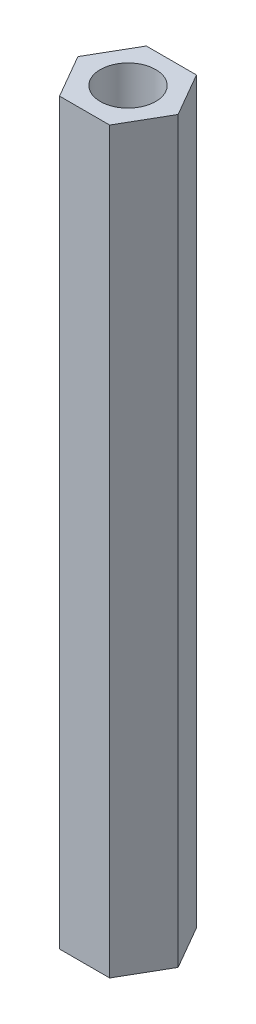
ISO-10303-21;
HEADER;
FILE_DESCRIPTION(('STEP AP214'),'2;1');
FILE_NAME('part.step','',(''),(''),'','','');
FILE_SCHEMA(('AUTOMOTIVE_DESIGN { 1 0 10303 214 1 1 1 1 }'));
ENDSEC;
DATA;
#1=APPLICATION_CONTEXT('core data for automotive mechanical design processes');
#2=APPLICATION_PROTOCOL_DEFINITION('international standard','automotive_design',2000,#1);
#3=PRODUCT_CONTEXT('',#1,'mechanical');
#4=PRODUCT('Part','Part','',(#3));
#5=PRODUCT_RELATED_PRODUCT_CATEGORY('part','',(#4));
#6=PRODUCT_DEFINITION_FORMATION('','',#4);
#7=PRODUCT_DEFINITION_CONTEXT('part definition',#1,'design');
#8=PRODUCT_DEFINITION('design','',#6,#7);
#9=PRODUCT_DEFINITION_SHAPE('','',#8);
#10=(LENGTH_UNIT() NAMED_UNIT(*) SI_UNIT(.MILLI.,.METRE.));
#11=(NAMED_UNIT(*) PLANE_ANGLE_UNIT() SI_UNIT($,.RADIAN.));
#12=(NAMED_UNIT(*) SI_UNIT($,.STERADIAN.) SOLID_ANGLE_UNIT());
#13=UNCERTAINTY_MEASURE_WITH_UNIT(LENGTH_MEASURE(1.E-05),#10,'distance_accuracy_value','');
#14=(GEOMETRIC_REPRESENTATION_CONTEXT(3) GLOBAL_UNCERTAINTY_ASSIGNED_CONTEXT((#13)) GLOBAL_UNIT_ASSIGNED_CONTEXT((#10,
#11,#12)) REPRESENTATION_CONTEXT('',''));
#15=CARTESIAN_POINT('',(0.,0.,0.));
#16=DIRECTION('',(0.,0.,1.));
#17=DIRECTION('',(1.,0.,0.));
#18=AXIS2_PLACEMENT_3D('',#15,#16,#17);
#19=CARTESIAN_POINT('',(0.,40.,0.));
#20=DIRECTION('',(0.,-1.,0.));
#21=DIRECTION('',(0.,0.,-1.));
#22=AXIS2_PLACEMENT_3D('',#19,#20,#21);
#23=PLANE('',#22);
#24=DIRECTION('',(-0.499999999999999,0.,0.866025403784439));
#25=VECTOR('',#24,1.);
#26=CARTESIAN_POINT('',(-2.71354626519124,40.,0.));
#27=LINE('',#26,#25);
#28=CARTESIAN_POINT('',(-1.35677313259562,40.,-2.35));
#29=VERTEX_POINT('',#28);
#30=CARTESIAN_POINT('',(-2.71354626519124,40.,0.));
#31=VERTEX_POINT('',#30);
#32=EDGE_CURVE('E146',#29,#31,#27,.T.);
#33=ORIENTED_EDGE('',*,*,#32,.T.);
#34=DIRECTION('',(0.500000000000003,0.,0.866025403784437));
#35=VECTOR('',#34,1.);
#36=CARTESIAN_POINT('',(-1.35677313259561,40.,2.35));
#37=LINE('',#36,#35);
#38=CARTESIAN_POINT('',(-1.35677313259561,40.,2.35));
#39=VERTEX_POINT('',#38);
#40=EDGE_CURVE('E94',#31,#39,#37,.T.);
#41=ORIENTED_EDGE('',*,*,#40,.T.);
#42=DIRECTION('',(1.,0.,0.));
#43=VECTOR('',#42,1.);
#44=CARTESIAN_POINT('',(1.35677313259563,40.,2.35));
#45=LINE('',#44,#43);
#46=CARTESIAN_POINT('',(1.35677313259563,40.,2.35));
#47=VERTEX_POINT('',#46);
#48=EDGE_CURVE('E107',#39,#47,#45,.T.);
#49=ORIENTED_EDGE('',*,*,#48,.T.);
#50=DIRECTION('',(0.500000000000001,0.,-0.866025403784438));
#51=VECTOR('',#50,1.);
#52=CARTESIAN_POINT('',(2.71354626519126,40.,0.));
#53=LINE('',#52,#51);
#54=CARTESIAN_POINT('',(2.71354626519126,40.,0.));
#55=VERTEX_POINT('',#54);
#56=EDGE_CURVE('E101',#47,#55,#53,.T.);
#57=ORIENTED_EDGE('',*,*,#56,.T.);
#58=DIRECTION('',(-0.500000000000002,0.,-0.866025403784437));
#59=VECTOR('',#58,1.);
#60=CARTESIAN_POINT('',(1.35677313259563,40.,-2.35));
#61=LINE('',#60,#59);
#62=CARTESIAN_POINT('',(1.35677313259563,40.,-2.35));
#63=VERTEX_POINT('',#62);
#64=EDGE_CURVE('E105',#55,#63,#61,.T.);
#65=ORIENTED_EDGE('',*,*,#64,.T.);
#66=DIRECTION('',(-1.,0.,0.));
#67=VECTOR('',#66,1.);
#68=CARTESIAN_POINT('',(-1.35677313259562,40.,-2.35));
#69=LINE('',#68,#67);
#70=EDGE_CURVE('E57',#63,#29,#69,.T.);
#71=ORIENTED_EDGE('',*,*,#70,.T.);
#72=EDGE_LOOP('',(#33,#41,#49,#57,#65,#71));
#73=FACE_BOUND('',#72,.T.);
#74=CARTESIAN_POINT('',(0.,40.,0.));
#75=DIRECTION('',(0.,1.,0.));
#76=DIRECTION('',(0.,0.,1.));
#77=AXIS2_PLACEMENT_3D('',#74,#75,#76);
#78=CIRCLE('',#77,1.5);
#79=CARTESIAN_POINT('',(0.,40.,1.5));
#80=VERTEX_POINT('',#79);
#81=EDGE_CURVE('E134',#80,#80,#78,.T.);
#82=ORIENTED_EDGE('',*,*,#81,.F.);
#83=EDGE_LOOP('',(#82));
#84=FACE_BOUND('',#83,.T.);
#85=ADVANCED_FACE('F39',(#73,#84),#23,.F.);
#86=CARTESIAN_POINT('',(0.,0.,0.));
#87=DIRECTION('',(0.,-1.,0.));
#88=DIRECTION('',(0.,0.,-1.));
#89=AXIS2_PLACEMENT_3D('',#86,#87,#88);
#90=PLANE('',#89);
#91=DIRECTION('',(-0.499999999999999,0.,0.866025403784439));
#92=VECTOR('',#91,1.);
#93=CARTESIAN_POINT('',(-2.71354626519124,0.,0.));
#94=LINE('',#93,#92);
#95=CARTESIAN_POINT('',(-1.35677313259562,0.,-2.35));
#96=VERTEX_POINT('',#95);
#97=CARTESIAN_POINT('',(-2.71354626519124,0.,0.));
#98=VERTEX_POINT('',#97);
#99=EDGE_CURVE('E129',#96,#98,#94,.T.);
#100=ORIENTED_EDGE('',*,*,#99,.F.);
#101=DIRECTION('',(-1.,0.,0.));
#102=VECTOR('',#101,1.);
#103=CARTESIAN_POINT('',(-1.35677313259562,0.,-2.35));
#104=LINE('',#103,#102);
#105=CARTESIAN_POINT('',(1.35677313259563,0.,-2.35));
#106=VERTEX_POINT('',#105);
#107=EDGE_CURVE('E86',#106,#96,#104,.T.);
#108=ORIENTED_EDGE('',*,*,#107,.F.);
#109=DIRECTION('',(-0.500000000000002,0.,-0.866025403784437));
#110=VECTOR('',#109,1.);
#111=CARTESIAN_POINT('',(1.35677313259563,0.,-2.35));
#112=LINE('',#111,#110);
#113=CARTESIAN_POINT('',(2.71354626519126,0.,0.));
#114=VERTEX_POINT('',#113);
#115=EDGE_CURVE('E80',#114,#106,#112,.T.);
#116=ORIENTED_EDGE('',*,*,#115,.F.);
#117=DIRECTION('',(0.500000000000001,0.,-0.866025403784438));
#118=VECTOR('',#117,1.);
#119=CARTESIAN_POINT('',(2.71354626519126,0.,0.));
#120=LINE('',#119,#118);
#121=CARTESIAN_POINT('',(1.35677313259563,0.,2.35));
#122=VERTEX_POINT('',#121);
#123=EDGE_CURVE('E116',#122,#114,#120,.T.);
#124=ORIENTED_EDGE('',*,*,#123,.F.);
#125=DIRECTION('',(1.,0.,0.));
#126=VECTOR('',#125,1.);
#127=CARTESIAN_POINT('',(1.35677313259563,0.,2.35));
#128=LINE('',#127,#126);
#129=CARTESIAN_POINT('',(-1.35677313259561,0.,2.35));
#130=VERTEX_POINT('',#129);
#131=EDGE_CURVE('E137',#130,#122,#128,.T.);
#132=ORIENTED_EDGE('',*,*,#131,.F.);
#133=DIRECTION('',(0.500000000000003,0.,0.866025403784437));
#134=VECTOR('',#133,1.);
#135=CARTESIAN_POINT('',(-1.35677313259561,0.,2.35));
#136=LINE('',#135,#134);
#137=EDGE_CURVE('E133',#98,#130,#136,.T.);
#138=ORIENTED_EDGE('',*,*,#137,.F.);
#139=EDGE_LOOP('',(#100,#108,#116,#124,#132,#138));
#140=FACE_BOUND('',#139,.T.);
#141=CARTESIAN_POINT('',(0.,0.,0.));
#142=DIRECTION('',(0.,1.,0.));
#143=DIRECTION('',(0.,0.,1.));
#144=AXIS2_PLACEMENT_3D('',#141,#142,#143);
#145=CIRCLE('',#144,1.5);
#146=CARTESIAN_POINT('',(0.,0.,1.5));
#147=VERTEX_POINT('',#146);
#148=EDGE_CURVE('E243',#147,#147,#145,.T.);
#149=ORIENTED_EDGE('',*,*,#148,.T.);
#150=EDGE_LOOP('',(#149));
#151=FACE_BOUND('',#150,.T.);
#152=ADVANCED_FACE('F159',(#140,#151),#90,.T.);
#153=CARTESIAN_POINT('',(-2.71354626519124,40.,0.));
#154=DIRECTION('',(0.866025403784439,0.,0.499999999999999));
#155=DIRECTION('',(0.499999999999999,0.,-0.866025403784439));
#156=AXIS2_PLACEMENT_3D('',#153,#154,#155);
#157=PLANE('',#156);
#158=ORIENTED_EDGE('',*,*,#99,.T.);
#159=DIRECTION('',(0.,-1.,0.));
#160=VECTOR('',#159,1.);
#161=CARTESIAN_POINT('',(-2.71354626519124,40.,0.));
#162=LINE('',#161,#160);
#163=EDGE_CURVE('E11',#31,#98,#162,.T.);
#164=ORIENTED_EDGE('',*,*,#163,.F.);
#165=ORIENTED_EDGE('',*,*,#32,.F.);
#166=DIRECTION('',(0.,-1.,0.));
#167=VECTOR('',#166,1.);
#168=CARTESIAN_POINT('',(-1.35677313259562,40.,-2.35));
#169=LINE('',#168,#167);
#170=EDGE_CURVE('E125',#29,#96,#169,.T.);
#171=ORIENTED_EDGE('',*,*,#170,.T.);
#172=EDGE_LOOP('',(#158,#164,#165,#171));
#173=FACE_BOUND('',#172,.T.);
#174=ADVANCED_FACE('F41',(#173),#157,.F.);
#175=CARTESIAN_POINT('',(-1.35677313259561,40.,2.35));
#176=DIRECTION('',(0.866025403784437,0.,-0.500000000000003));
#177=DIRECTION('',(-0.500000000000003,0.,-0.866025403784437));
#178=AXIS2_PLACEMENT_3D('',#175,#176,#177);
#179=PLANE('',#178);
#180=ORIENTED_EDGE('',*,*,#137,.T.);
#181=DIRECTION('',(0.,-1.,0.));
#182=VECTOR('',#181,1.);
#183=CARTESIAN_POINT('',(-1.35677313259561,40.,2.35));
#184=LINE('',#183,#182);
#185=EDGE_CURVE('E49',#39,#130,#184,.T.);
#186=ORIENTED_EDGE('',*,*,#185,.F.);
#187=ORIENTED_EDGE('',*,*,#40,.F.);
#188=ORIENTED_EDGE('',*,*,#163,.T.);
#189=EDGE_LOOP('',(#180,#186,#187,#188));
#190=FACE_BOUND('',#189,.T.);
#191=ADVANCED_FACE('F184',(#190),#179,.F.);
#192=CARTESIAN_POINT('',(1.35677313259563,40.,2.35));
#193=DIRECTION('',(0.,0.,-1.));
#194=DIRECTION('',(-1.,0.,0.));
#195=AXIS2_PLACEMENT_3D('',#192,#193,#194);
#196=PLANE('',#195);
#197=ORIENTED_EDGE('',*,*,#131,.T.);
#198=DIRECTION('',(0.,-1.,0.));
#199=VECTOR('',#198,1.);
#200=CARTESIAN_POINT('',(1.35677313259563,40.,2.35));
#201=LINE('',#200,#199);
#202=EDGE_CURVE('E118',#47,#122,#201,.T.);
#203=ORIENTED_EDGE('',*,*,#202,.F.);
#204=ORIENTED_EDGE('',*,*,#48,.F.);
#205=ORIENTED_EDGE('',*,*,#185,.T.);
#206=EDGE_LOOP('',(#197,#203,#204,#205));
#207=FACE_BOUND('',#206,.T.);
#208=ADVANCED_FACE('F156',(#207),#196,.F.);
#209=CARTESIAN_POINT('',(2.71354626519126,40.,0.));
#210=DIRECTION('',(-0.866025403784438,0.,-0.500000000000001));
#211=DIRECTION('',(-0.500000000000001,0.,0.866025403784438));
#212=AXIS2_PLACEMENT_3D('',#209,#210,#211);
#213=PLANE('',#212);
#214=ORIENTED_EDGE('',*,*,#123,.T.);
#215=DIRECTION('',(0.,-1.,0.));
#216=VECTOR('',#215,1.);
#217=CARTESIAN_POINT('',(2.71354626519126,40.,0.));
#218=LINE('',#217,#216);
#219=EDGE_CURVE('E113',#55,#114,#218,.T.);
#220=ORIENTED_EDGE('',*,*,#219,.F.);
#221=ORIENTED_EDGE('',*,*,#56,.F.);
#222=ORIENTED_EDGE('',*,*,#202,.T.);
#223=EDGE_LOOP('',(#214,#220,#221,#222));
#224=FACE_BOUND('',#223,.T.);
#225=ADVANCED_FACE('F114',(#224),#213,.F.);
#226=CARTESIAN_POINT('',(1.35677313259563,40.,-2.35));
#227=DIRECTION('',(-0.866025403784437,0.,0.500000000000002));
#228=DIRECTION('',(0.500000000000002,0.,0.866025403784437));
#229=AXIS2_PLACEMENT_3D('',#226,#227,#228);
#230=PLANE('',#229);
#231=ORIENTED_EDGE('',*,*,#115,.T.);
#232=DIRECTION('',(0.,-1.,0.));
#233=VECTOR('',#232,1.);
#234=CARTESIAN_POINT('',(1.35677313259563,40.,-2.35));
#235=LINE('',#234,#233);
#236=EDGE_CURVE('E119',#63,#106,#235,.T.);
#237=ORIENTED_EDGE('',*,*,#236,.F.);
#238=ORIENTED_EDGE('',*,*,#64,.F.);
#239=ORIENTED_EDGE('',*,*,#219,.T.);
#240=EDGE_LOOP('',(#231,#237,#238,#239));
#241=FACE_BOUND('',#240,.T.);
#242=ADVANCED_FACE('F121',(#241),#230,.F.);
#243=CARTESIAN_POINT('',(-1.35677313259562,40.,-2.35));
#244=DIRECTION('',(0.,0.,1.));
#245=DIRECTION('',(1.,0.,0.));
#246=AXIS2_PLACEMENT_3D('',#243,#244,#245);
#247=PLANE('',#246);
#248=ORIENTED_EDGE('',*,*,#107,.T.);
#249=ORIENTED_EDGE('',*,*,#170,.F.);
#250=ORIENTED_EDGE('',*,*,#70,.F.);
#251=ORIENTED_EDGE('',*,*,#236,.T.);
#252=EDGE_LOOP('',(#248,#249,#250,#251));
#253=FACE_BOUND('',#252,.T.);
#254=ADVANCED_FACE('F164',(#253),#247,.F.);
#255=CARTESIAN_POINT('',(0.,40.,0.));
#256=DIRECTION('',(0.,-1.,0.));
#257=DIRECTION('',(0.,0.,-1.));
#258=AXIS2_PLACEMENT_3D('',#255,#256,#257);
#259=CYLINDRICAL_SURFACE('',#258,1.5);
#260=ORIENTED_EDGE('',*,*,#81,.T.);
#261=EDGE_LOOP('',(#260));
#262=FACE_BOUND('',#261,.T.);
#263=ORIENTED_EDGE('',*,*,#148,.F.);
#264=EDGE_LOOP('',(#263));
#265=FACE_BOUND('',#264,.T.);
#266=ADVANCED_FACE('F166',(#262,#265),#259,.F.);
#267=CLOSED_SHELL('',(#85,#152,#174,#191,#208,#225,#242,#254,#266));
#268=MANIFOLD_SOLID_BREP('B2',#267);
#269=ADVANCED_BREP_SHAPE_REPRESENTATION('',(#18,#268),#14);
#270=SHAPE_DEFINITION_REPRESENTATION(#9,#269);
ENDSEC;
END-ISO-10303-21;
